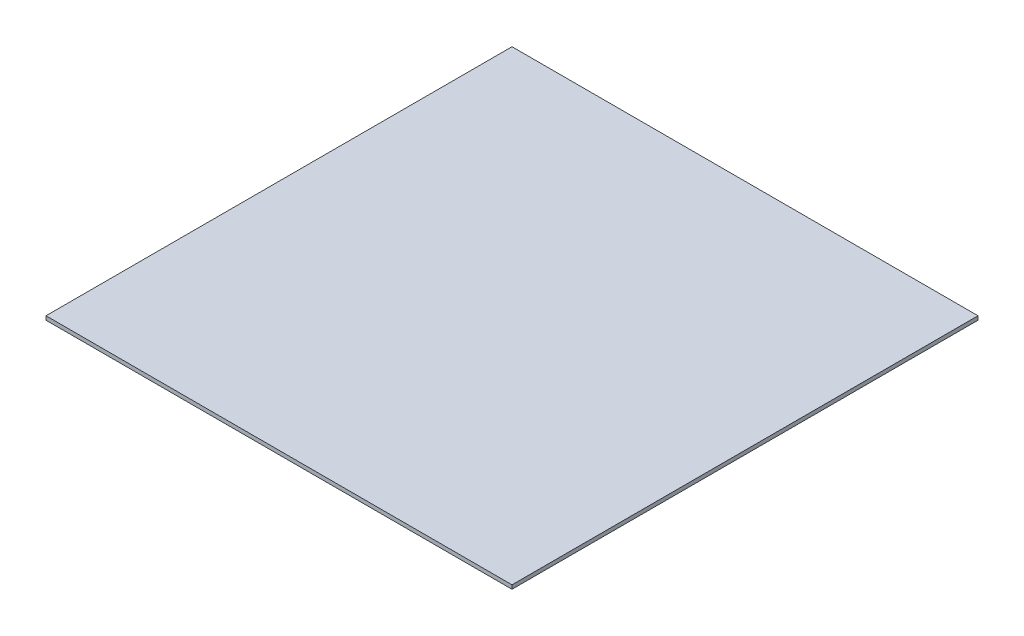
ISO-10303-21;
HEADER;
FILE_DESCRIPTION(('STEP AP214'),'2;1');
FILE_NAME('part.step','',(''),(''),'','','');
FILE_SCHEMA(('AUTOMOTIVE_DESIGN { 1 0 10303 214 1 1 1 1 }'));
ENDSEC;
DATA;
#1=APPLICATION_CONTEXT('core data for automotive mechanical design processes');
#2=APPLICATION_PROTOCOL_DEFINITION('international standard','automotive_design',2000,#1);
#3=PRODUCT_CONTEXT('',#1,'mechanical');
#4=PRODUCT('Part','Part','',(#3));
#5=PRODUCT_RELATED_PRODUCT_CATEGORY('part','',(#4));
#6=PRODUCT_DEFINITION_FORMATION('','',#4);
#7=PRODUCT_DEFINITION_CONTEXT('part definition',#1,'design');
#8=PRODUCT_DEFINITION('design','',#6,#7);
#9=PRODUCT_DEFINITION_SHAPE('','',#8);
#10=(LENGTH_UNIT() NAMED_UNIT(*) SI_UNIT(.MILLI.,.METRE.));
#11=(NAMED_UNIT(*) PLANE_ANGLE_UNIT() SI_UNIT($,.RADIAN.));
#12=(NAMED_UNIT(*) SI_UNIT($,.STERADIAN.) SOLID_ANGLE_UNIT());
#13=UNCERTAINTY_MEASURE_WITH_UNIT(LENGTH_MEASURE(1.E-05),#10,'distance_accuracy_value','');
#14=(GEOMETRIC_REPRESENTATION_CONTEXT(3) GLOBAL_UNCERTAINTY_ASSIGNED_CONTEXT((#13)) GLOBAL_UNIT_ASSIGNED_CONTEXT((#10,
#11,#12)) REPRESENTATION_CONTEXT('',''));
#15=CARTESIAN_POINT('',(0.,0.,0.));
#16=DIRECTION('',(0.,0.,1.));
#17=DIRECTION('',(1.,0.,0.));
#18=AXIS2_PLACEMENT_3D('',#15,#16,#17);
#19=CARTESIAN_POINT('',(280.925542803738,-1097.57331258805,-706.917252353689));
#20=DIRECTION('',(-1.,0.,0.));
#21=DIRECTION('',(0.,0.,1.));
#22=AXIS2_PLACEMENT_3D('',#19,#20,#21);
#23=PLANE('',#22);
#24=DIRECTION('',(0.,0.,1.));
#25=VECTOR('',#24,1.);
#26=CARTESIAN_POINT('',(280.925542803738,-1092.57331258805,-706.917252353689));
#27=LINE('',#26,#25);
#28=CARTESIAN_POINT('',(280.925542803738,-1092.57331258805,-706.917252353689));
#29=VERTEX_POINT('',#28);
#30=CARTESIAN_POINT('',(280.925542803738,-1092.57331258805,-106.917252353689));
#31=VERTEX_POINT('',#30);
#32=EDGE_CURVE('E95',#29,#31,#27,.T.);
#33=ORIENTED_EDGE('',*,*,#32,.T.);
#34=DIRECTION('',(0.,1.,0.));
#35=VECTOR('',#34,1.);
#36=CARTESIAN_POINT('',(280.925542803738,-1097.57331258805,-106.917252353689));
#37=LINE('',#36,#35);
#38=CARTESIAN_POINT('',(280.925542803738,-1097.57331258805,-106.917252353689));
#39=VERTEX_POINT('',#38);
#40=EDGE_CURVE('E11',#39,#31,#37,.T.);
#41=ORIENTED_EDGE('',*,*,#40,.F.);
#42=DIRECTION('',(0.,0.,1.));
#43=VECTOR('',#42,1.);
#44=CARTESIAN_POINT('',(280.925542803738,-1097.57331258805,-706.917252353689));
#45=LINE('',#44,#43);
#46=CARTESIAN_POINT('',(280.925542803738,-1097.57331258805,-706.917252353689));
#47=VERTEX_POINT('',#46);
#48=EDGE_CURVE('E81',#47,#39,#45,.T.);
#49=ORIENTED_EDGE('',*,*,#48,.F.);
#50=DIRECTION('',(0.,1.,0.));
#51=VECTOR('',#50,1.);
#52=CARTESIAN_POINT('',(280.925542803738,-1097.57331258805,-706.917252353689));
#53=LINE('',#52,#51);
#54=EDGE_CURVE('E48',#47,#29,#53,.T.);
#55=ORIENTED_EDGE('',*,*,#54,.T.);
#56=EDGE_LOOP('',(#33,#41,#49,#55));
#57=FACE_BOUND('',#56,.T.);
#58=ADVANCED_FACE('F32',(#57),#23,.F.);
#59=CARTESIAN_POINT('',(280.925542803738,-1097.57331258805,-106.917252353689));
#60=DIRECTION('',(0.,0.,-1.));
#61=DIRECTION('',(-1.,0.,0.));
#62=AXIS2_PLACEMENT_3D('',#59,#60,#61);
#63=PLANE('',#62);
#64=DIRECTION('',(-1.,0.,0.));
#65=VECTOR('',#64,1.);
#66=CARTESIAN_POINT('',(280.925542803738,-1092.57331258805,-106.917252353689));
#67=LINE('',#66,#65);
#68=CARTESIAN_POINT('',(-319.074457196262,-1092.57331258805,-106.917252353689));
#69=VERTEX_POINT('',#68);
#70=EDGE_CURVE('E86',#31,#69,#67,.T.);
#71=ORIENTED_EDGE('',*,*,#70,.T.);
#72=DIRECTION('',(0.,1.,0.));
#73=VECTOR('',#72,1.);
#74=CARTESIAN_POINT('',(-319.074457196262,-1097.57331258805,-106.917252353689));
#75=LINE('',#74,#73);
#76=CARTESIAN_POINT('',(-319.074457196262,-1097.57331258805,-106.917252353689));
#77=VERTEX_POINT('',#76);
#78=EDGE_CURVE('E40',#77,#69,#75,.T.);
#79=ORIENTED_EDGE('',*,*,#78,.F.);
#80=DIRECTION('',(-1.,0.,0.));
#81=VECTOR('',#80,1.);
#82=CARTESIAN_POINT('',(280.925542803738,-1097.57331258805,-106.917252353689));
#83=LINE('',#82,#81);
#84=EDGE_CURVE('E73',#39,#77,#83,.T.);
#85=ORIENTED_EDGE('',*,*,#84,.F.);
#86=ORIENTED_EDGE('',*,*,#40,.T.);
#87=EDGE_LOOP('',(#71,#79,#85,#86));
#88=FACE_BOUND('',#87,.T.);
#89=ADVANCED_FACE('F85',(#88),#63,.F.);
#90=CARTESIAN_POINT('',(-319.074457196262,-1097.57331258805,-706.917252353689));
#91=DIRECTION('',(-1.,0.,0.));
#92=DIRECTION('',(0.,0.,1.));
#93=AXIS2_PLACEMENT_3D('',#90,#91,#92);
#94=PLANE('',#93);
#95=DIRECTION('',(0.,0.,1.));
#96=VECTOR('',#95,1.);
#97=CARTESIAN_POINT('',(-319.074457196262,-1092.57331258805,-706.917252353689));
#98=LINE('',#97,#96);
#99=CARTESIAN_POINT('',(-319.074457196262,-1092.57331258805,-706.917252353689));
#100=VERTEX_POINT('',#99);
#101=EDGE_CURVE('E98',#100,#69,#98,.T.);
#102=ORIENTED_EDGE('',*,*,#101,.F.);
#103=DIRECTION('',(0.,1.,0.));
#104=VECTOR('',#103,1.);
#105=CARTESIAN_POINT('',(-319.074457196262,-1097.57331258805,-706.917252353689));
#106=LINE('',#105,#104);
#107=CARTESIAN_POINT('',(-319.074457196262,-1097.57331258805,-706.917252353689));
#108=VERTEX_POINT('',#107);
#109=EDGE_CURVE('E62',#108,#100,#106,.T.);
#110=ORIENTED_EDGE('',*,*,#109,.F.);
#111=DIRECTION('',(0.,0.,1.));
#112=VECTOR('',#111,1.);
#113=CARTESIAN_POINT('',(-319.074457196262,-1097.57331258805,-706.917252353689));
#114=LINE('',#113,#112);
#115=EDGE_CURVE('E80',#108,#77,#114,.T.);
#116=ORIENTED_EDGE('',*,*,#115,.T.);
#117=ORIENTED_EDGE('',*,*,#78,.T.);
#118=EDGE_LOOP('',(#102,#110,#116,#117));
#119=FACE_BOUND('',#118,.T.);
#120=ADVANCED_FACE('F89',(#119),#94,.T.);
#121=CARTESIAN_POINT('',(280.925542803738,-1097.57331258805,-706.917252353689));
#122=DIRECTION('',(0.,0.,-1.));
#123=DIRECTION('',(-1.,0.,0.));
#124=AXIS2_PLACEMENT_3D('',#121,#122,#123);
#125=PLANE('',#124);
#126=DIRECTION('',(-1.,0.,0.));
#127=VECTOR('',#126,1.);
#128=CARTESIAN_POINT('',(280.925542803738,-1092.57331258805,-706.917252353689));
#129=LINE('',#128,#127);
#130=EDGE_CURVE('E100',#29,#100,#129,.T.);
#131=ORIENTED_EDGE('',*,*,#130,.F.);
#132=ORIENTED_EDGE('',*,*,#54,.F.);
#133=DIRECTION('',(-1.,0.,0.));
#134=VECTOR('',#133,1.);
#135=CARTESIAN_POINT('',(280.925542803738,-1097.57331258805,-706.917252353689));
#136=LINE('',#135,#134);
#137=EDGE_CURVE('E90',#47,#108,#136,.T.);
#138=ORIENTED_EDGE('',*,*,#137,.T.);
#139=ORIENTED_EDGE('',*,*,#109,.T.);
#140=EDGE_LOOP('',(#131,#132,#138,#139));
#141=FACE_BOUND('',#140,.T.);
#142=ADVANCED_FACE('F106',(#141),#125,.T.);
#143=CARTESIAN_POINT('',(0.,-1097.57331258805,0.));
#144=DIRECTION('',(0.,-1.,0.));
#145=DIRECTION('',(0.,0.,-1.));
#146=AXIS2_PLACEMENT_3D('',#143,#144,#145);
#147=PLANE('',#146);
#148=ORIENTED_EDGE('',*,*,#48,.T.);
#149=ORIENTED_EDGE('',*,*,#84,.T.);
#150=ORIENTED_EDGE('',*,*,#115,.F.);
#151=ORIENTED_EDGE('',*,*,#137,.F.);
#152=EDGE_LOOP('',(#148,#149,#150,#151));
#153=FACE_BOUND('',#152,.T.);
#154=ADVANCED_FACE('F77',(#153),#147,.T.);
#155=CARTESIAN_POINT('',(0.,-1092.57331258805,0.));
#156=DIRECTION('',(0.,-1.,0.));
#157=DIRECTION('',(0.,0.,-1.));
#158=AXIS2_PLACEMENT_3D('',#155,#156,#157);
#159=PLANE('',#158);
#160=ORIENTED_EDGE('',*,*,#32,.F.);
#161=ORIENTED_EDGE('',*,*,#130,.T.);
#162=ORIENTED_EDGE('',*,*,#101,.T.);
#163=ORIENTED_EDGE('',*,*,#70,.F.);
#164=EDGE_LOOP('',(#160,#161,#162,#163));
#165=FACE_BOUND('',#164,.T.);
#166=ADVANCED_FACE('F105',(#165),#159,.F.);
#167=CLOSED_SHELL('',(#58,#89,#120,#142,#154,#166));
#168=MANIFOLD_SOLID_BREP('B2',#167);
#169=ADVANCED_BREP_SHAPE_REPRESENTATION('',(#18,#168),#14);
#170=SHAPE_DEFINITION_REPRESENTATION(#9,#169);
ENDSEC;
END-ISO-10303-21;
